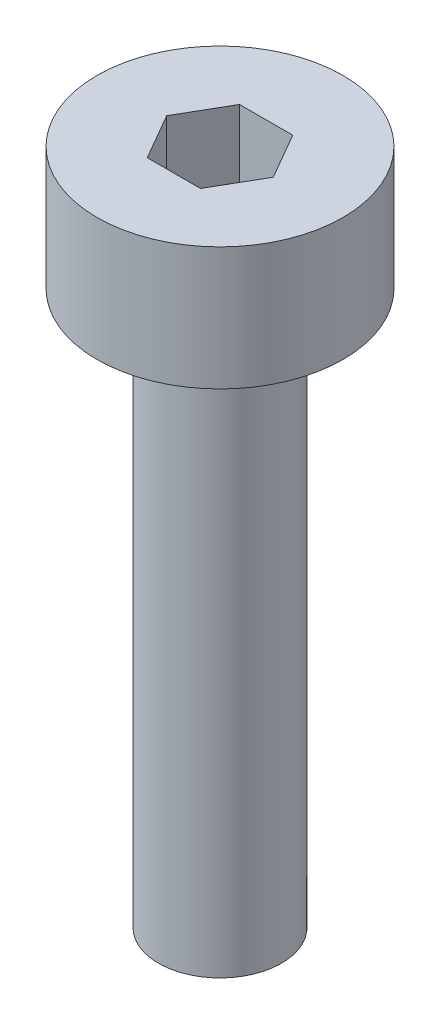
ISO-10303-21;
HEADER;
FILE_DESCRIPTION(('STEP AP214'),'2;1');
FILE_NAME('part.step','',(''),(''),'','','');
FILE_SCHEMA(('AUTOMOTIVE_DESIGN { 1 0 10303 214 1 1 1 1 }'));
ENDSEC;
DATA;
#1=APPLICATION_CONTEXT('core data for automotive mechanical design processes');
#2=APPLICATION_PROTOCOL_DEFINITION('international standard','automotive_design',2000,#1);
#3=PRODUCT_CONTEXT('',#1,'mechanical');
#4=PRODUCT('Part','Part','',(#3));
#5=PRODUCT_RELATED_PRODUCT_CATEGORY('part','',(#4));
#6=PRODUCT_DEFINITION_FORMATION('','',#4);
#7=PRODUCT_DEFINITION_CONTEXT('part definition',#1,'design');
#8=PRODUCT_DEFINITION('design','',#6,#7);
#9=PRODUCT_DEFINITION_SHAPE('','',#8);
#10=(LENGTH_UNIT() NAMED_UNIT(*) SI_UNIT(.MILLI.,.METRE.));
#11=(NAMED_UNIT(*) PLANE_ANGLE_UNIT() SI_UNIT($,.RADIAN.));
#12=(NAMED_UNIT(*) SI_UNIT($,.STERADIAN.) SOLID_ANGLE_UNIT());
#13=UNCERTAINTY_MEASURE_WITH_UNIT(LENGTH_MEASURE(1.E-05),#10,'distance_accuracy_value','');
#14=(GEOMETRIC_REPRESENTATION_CONTEXT(3) GLOBAL_UNCERTAINTY_ASSIGNED_CONTEXT((#13)) GLOBAL_UNIT_ASSIGNED_CONTEXT((#10,
#11,#12)) REPRESENTATION_CONTEXT('',''));
#15=CARTESIAN_POINT('',(0.,0.,0.));
#16=DIRECTION('',(0.,0.,1.));
#17=DIRECTION('',(1.,0.,0.));
#18=AXIS2_PLACEMENT_3D('',#15,#16,#17);
#19=CARTESIAN_POINT('',(0.,2.,0.));
#20=DIRECTION('',(0.,-1.,0.));
#21=DIRECTION('',(0.,0.,-1.));
#22=AXIS2_PLACEMENT_3D('',#19,#20,#21);
#23=CYLINDRICAL_SURFACE('',#22,2.);
#24=CARTESIAN_POINT('',(0.,2.,0.));
#25=DIRECTION('',(0.,1.,0.));
#26=DIRECTION('',(0.,0.,1.));
#27=AXIS2_PLACEMENT_3D('',#24,#25,#26);
#28=CIRCLE('',#27,2.);
#29=CARTESIAN_POINT('',(0.,2.,2.));
#30=VERTEX_POINT('',#29);
#31=EDGE_CURVE('E43',#30,#30,#28,.T.);
#32=ORIENTED_EDGE('',*,*,#31,.F.);
#33=EDGE_LOOP('',(#32));
#34=FACE_BOUND('',#33,.T.);
#35=CARTESIAN_POINT('',(0.,0.,0.));
#36=DIRECTION('',(0.,1.,0.));
#37=DIRECTION('',(0.,0.,1.));
#38=AXIS2_PLACEMENT_3D('',#35,#36,#37);
#39=CIRCLE('',#38,2.);
#40=CARTESIAN_POINT('',(0.,0.,2.));
#41=VERTEX_POINT('',#40);
#42=EDGE_CURVE('E38',#41,#41,#39,.T.);
#43=ORIENTED_EDGE('',*,*,#42,.T.);
#44=EDGE_LOOP('',(#43));
#45=FACE_BOUND('',#44,.T.);
#46=ADVANCED_FACE('F35',(#34,#45),#23,.T.);
#47=CARTESIAN_POINT('',(0.,2.,0.));
#48=DIRECTION('',(0.,1.,0.));
#49=DIRECTION('',(0.,0.,1.));
#50=AXIS2_PLACEMENT_3D('',#47,#48,#49);
#51=PLANE('',#50);
#52=DIRECTION('',(0.5,0.,-0.866025403784439));
#53=VECTOR('',#52,1.);
#54=CARTESIAN_POINT('',(0.433012701892219,2.,0.75));
#55=LINE('',#54,#53);
#56=CARTESIAN_POINT('',(0.433012701892219,2.,0.75));
#57=VERTEX_POINT('',#56);
#58=CARTESIAN_POINT('',(0.866025403784438,2.,0.));
#59=VERTEX_POINT('',#58);
#60=EDGE_CURVE('E51',#57,#59,#55,.T.);
#61=ORIENTED_EDGE('',*,*,#60,.F.);
#62=DIRECTION('',(1.,0.,0.));
#63=VECTOR('',#62,1.);
#64=CARTESIAN_POINT('',(-0.43301270189222,2.,0.75));
#65=LINE('',#64,#63);
#66=CARTESIAN_POINT('',(-0.43301270189222,2.,0.75));
#67=VERTEX_POINT('',#66);
#68=EDGE_CURVE('E135',#67,#57,#65,.T.);
#69=ORIENTED_EDGE('',*,*,#68,.F.);
#70=DIRECTION('',(0.5,0.,0.866025403784439));
#71=VECTOR('',#70,1.);
#72=CARTESIAN_POINT('',(-0.866025403784439,2.,0.));
#73=LINE('',#72,#71);
#74=CARTESIAN_POINT('',(-0.866025403784439,2.,0.));
#75=VERTEX_POINT('',#74);
#76=EDGE_CURVE('E133',#75,#67,#73,.T.);
#77=ORIENTED_EDGE('',*,*,#76,.F.);
#78=DIRECTION('',(-0.5,0.,0.866025403784439));
#79=VECTOR('',#78,1.);
#80=CARTESIAN_POINT('',(-0.43301270189222,2.,-0.750000000000001));
#81=LINE('',#80,#79);
#82=CARTESIAN_POINT('',(-0.43301270189222,2.,-0.750000000000001));
#83=VERTEX_POINT('',#82);
#84=EDGE_CURVE('E99',#83,#75,#81,.T.);
#85=ORIENTED_EDGE('',*,*,#84,.F.);
#86=DIRECTION('',(-1.,0.,0.));
#87=VECTOR('',#86,1.);
#88=CARTESIAN_POINT('',(0.433012701892219,2.,-0.75));
#89=LINE('',#88,#87);
#90=CARTESIAN_POINT('',(0.433012701892219,2.,-0.75));
#91=VERTEX_POINT('',#90);
#92=EDGE_CURVE('E129',#91,#83,#89,.T.);
#93=ORIENTED_EDGE('',*,*,#92,.F.);
#94=DIRECTION('',(-0.5,0.,-0.866025403784439));
#95=VECTOR('',#94,1.);
#96=CARTESIAN_POINT('',(0.866025403784438,2.,0.));
#97=LINE('',#96,#95);
#98=EDGE_CURVE('E125',#59,#91,#97,.T.);
#99=ORIENTED_EDGE('',*,*,#98,.F.);
#100=EDGE_LOOP('',(#61,#69,#77,#85,#93,#99));
#101=FACE_BOUND('',#100,.T.);
#102=ORIENTED_EDGE('',*,*,#31,.T.);
#103=EDGE_LOOP('',(#102));
#104=FACE_BOUND('',#103,.T.);
#105=ADVANCED_FACE('F153',(#101,#104),#51,.T.);
#106=CARTESIAN_POINT('',(0.,0.,0.));
#107=DIRECTION('',(0.,1.,0.));
#108=DIRECTION('',(0.,0.,1.));
#109=AXIS2_PLACEMENT_3D('',#106,#107,#108);
#110=PLANE('',#109);
#111=CARTESIAN_POINT('',(0.,0.,0.));
#112=DIRECTION('',(0.,-1.,0.));
#113=DIRECTION('',(0.,0.,-1.));
#114=AXIS2_PLACEMENT_3D('',#111,#112,#113);
#115=CIRCLE('',#114,1.);
#116=CARTESIAN_POINT('',(0.,0.,-1.));
#117=VERTEX_POINT('',#116);
#118=EDGE_CURVE('E11',#117,#117,#115,.T.);
#119=ORIENTED_EDGE('',*,*,#118,.F.);
#120=EDGE_LOOP('',(#119));
#121=FACE_BOUND('',#120,.T.);
#122=ORIENTED_EDGE('',*,*,#42,.F.);
#123=EDGE_LOOP('',(#122));
#124=FACE_BOUND('',#123,.T.);
#125=ADVANCED_FACE('F150',(#121,#124),#110,.F.);
#126=CARTESIAN_POINT('',(0.433012701892219,0.5,0.75));
#127=DIRECTION('',(0.866025403784439,0.,0.5));
#128=DIRECTION('',(0.5,0.,-0.866025403784439));
#129=AXIS2_PLACEMENT_3D('',#126,#127,#128);
#130=PLANE('',#129);
#131=ORIENTED_EDGE('',*,*,#60,.T.);
#132=DIRECTION('',(0.,1.,0.));
#133=VECTOR('',#132,1.);
#134=CARTESIAN_POINT('',(0.866025403784438,0.5,0.));
#135=LINE('',#134,#133);
#136=CARTESIAN_POINT('',(0.866025403784438,0.5,0.));
#137=VERTEX_POINT('',#136);
#138=EDGE_CURVE('E81',#137,#59,#135,.T.);
#139=ORIENTED_EDGE('',*,*,#138,.F.);
#140=DIRECTION('',(0.5,0.,-0.866025403784439));
#141=VECTOR('',#140,1.);
#142=CARTESIAN_POINT('',(0.433012701892219,0.5,0.75));
#143=LINE('',#142,#141);
#144=CARTESIAN_POINT('',(0.433012701892219,0.5,0.75));
#145=VERTEX_POINT('',#144);
#146=EDGE_CURVE('E137',#145,#137,#143,.T.);
#147=ORIENTED_EDGE('',*,*,#146,.F.);
#148=DIRECTION('',(0.,1.,0.));
#149=VECTOR('',#148,1.);
#150=CARTESIAN_POINT('',(0.433012701892219,0.5,0.75));
#151=LINE('',#150,#149);
#152=EDGE_CURVE('E59',#145,#57,#151,.T.);
#153=ORIENTED_EDGE('',*,*,#152,.T.);
#154=EDGE_LOOP('',(#131,#139,#147,#153));
#155=FACE_BOUND('',#154,.T.);
#156=ADVANCED_FACE('F152',(#155),#130,.F.);
#157=CARTESIAN_POINT('',(-0.43301270189222,0.5,0.75));
#158=DIRECTION('',(0.,0.,1.));
#159=DIRECTION('',(1.,0.,0.));
#160=AXIS2_PLACEMENT_3D('',#157,#158,#159);
#161=PLANE('',#160);
#162=ORIENTED_EDGE('',*,*,#68,.T.);
#163=ORIENTED_EDGE('',*,*,#152,.F.);
#164=DIRECTION('',(1.,0.,0.));
#165=VECTOR('',#164,1.);
#166=CARTESIAN_POINT('',(-0.43301270189222,0.5,0.75));
#167=LINE('',#166,#165);
#168=CARTESIAN_POINT('',(-0.43301270189222,0.5,0.75));
#169=VERTEX_POINT('',#168);
#170=EDGE_CURVE('E111',#169,#145,#167,.T.);
#171=ORIENTED_EDGE('',*,*,#170,.F.);
#172=DIRECTION('',(0.,1.,0.));
#173=VECTOR('',#172,1.);
#174=CARTESIAN_POINT('',(-0.43301270189222,0.5,0.75));
#175=LINE('',#174,#173);
#176=EDGE_CURVE('E103',#169,#67,#175,.T.);
#177=ORIENTED_EDGE('',*,*,#176,.T.);
#178=EDGE_LOOP('',(#162,#163,#171,#177));
#179=FACE_BOUND('',#178,.T.);
#180=ADVANCED_FACE('F159',(#179),#161,.F.);
#181=CARTESIAN_POINT('',(-0.866025403784439,0.5,0.));
#182=DIRECTION('',(-0.866025403784439,0.,0.5));
#183=DIRECTION('',(0.5,0.,0.866025403784439));
#184=AXIS2_PLACEMENT_3D('',#181,#182,#183);
#185=PLANE('',#184);
#186=ORIENTED_EDGE('',*,*,#76,.T.);
#187=ORIENTED_EDGE('',*,*,#176,.F.);
#188=DIRECTION('',(0.5,0.,0.866025403784439));
#189=VECTOR('',#188,1.);
#190=CARTESIAN_POINT('',(-0.866025403784439,0.5,0.));
#191=LINE('',#190,#189);
#192=CARTESIAN_POINT('',(-0.866025403784439,0.5,0.));
#193=VERTEX_POINT('',#192);
#194=EDGE_CURVE('E107',#193,#169,#191,.T.);
#195=ORIENTED_EDGE('',*,*,#194,.F.);
#196=DIRECTION('',(0.,1.,0.));
#197=VECTOR('',#196,1.);
#198=CARTESIAN_POINT('',(-0.866025403784439,0.5,0.));
#199=LINE('',#198,#197);
#200=EDGE_CURVE('E92',#193,#75,#199,.T.);
#201=ORIENTED_EDGE('',*,*,#200,.T.);
#202=EDGE_LOOP('',(#186,#187,#195,#201));
#203=FACE_BOUND('',#202,.T.);
#204=ADVANCED_FACE('F108',(#203),#185,.F.);
#205=CARTESIAN_POINT('',(-0.43301270189222,0.5,-0.750000000000001));
#206=DIRECTION('',(-0.866025403784439,0.,-0.5));
#207=DIRECTION('',(-0.5,0.,0.866025403784439));
#208=AXIS2_PLACEMENT_3D('',#205,#206,#207);
#209=PLANE('',#208);
#210=ORIENTED_EDGE('',*,*,#84,.T.);
#211=ORIENTED_EDGE('',*,*,#200,.F.);
#212=DIRECTION('',(-0.5,0.,0.866025403784439));
#213=VECTOR('',#212,1.);
#214=CARTESIAN_POINT('',(-0.43301270189222,0.5,-0.750000000000001));
#215=LINE('',#214,#213);
#216=CARTESIAN_POINT('',(-0.43301270189222,0.5,-0.750000000000001));
#217=VERTEX_POINT('',#216);
#218=EDGE_CURVE('E96',#217,#193,#215,.T.);
#219=ORIENTED_EDGE('',*,*,#218,.F.);
#220=DIRECTION('',(0.,1.,0.));
#221=VECTOR('',#220,1.);
#222=CARTESIAN_POINT('',(-0.43301270189222,0.5,-0.750000000000001));
#223=LINE('',#222,#221);
#224=EDGE_CURVE('E104',#217,#83,#223,.T.);
#225=ORIENTED_EDGE('',*,*,#224,.T.);
#226=EDGE_LOOP('',(#210,#211,#219,#225));
#227=FACE_BOUND('',#226,.T.);
#228=ADVANCED_FACE('F94',(#227),#209,.F.);
#229=CARTESIAN_POINT('',(0.433012701892219,0.5,-0.75));
#230=DIRECTION('',(0.,0.,-1.));
#231=DIRECTION('',(-1.,0.,0.));
#232=AXIS2_PLACEMENT_3D('',#229,#230,#231);
#233=PLANE('',#232);
#234=ORIENTED_EDGE('',*,*,#92,.T.);
#235=ORIENTED_EDGE('',*,*,#224,.F.);
#236=DIRECTION('',(-1.,0.,0.));
#237=VECTOR('',#236,1.);
#238=CARTESIAN_POINT('',(0.433012701892219,0.5,-0.75));
#239=LINE('',#238,#237);
#240=CARTESIAN_POINT('',(0.433012701892219,0.5,-0.75));
#241=VERTEX_POINT('',#240);
#242=EDGE_CURVE('E117',#241,#217,#239,.T.);
#243=ORIENTED_EDGE('',*,*,#242,.F.);
#244=DIRECTION('',(0.,1.,0.));
#245=VECTOR('',#244,1.);
#246=CARTESIAN_POINT('',(0.433012701892219,0.5,-0.75));
#247=LINE('',#246,#245);
#248=EDGE_CURVE('E141',#241,#91,#247,.T.);
#249=ORIENTED_EDGE('',*,*,#248,.T.);
#250=EDGE_LOOP('',(#234,#235,#243,#249));
#251=FACE_BOUND('',#250,.T.);
#252=ADVANCED_FACE('F204',(#251),#233,.F.);
#253=CARTESIAN_POINT('',(0.866025403784438,0.5,0.));
#254=DIRECTION('',(0.866025403784438,0.,-0.5));
#255=DIRECTION('',(-0.5,0.,-0.866025403784439));
#256=AXIS2_PLACEMENT_3D('',#253,#254,#255);
#257=PLANE('',#256);
#258=ORIENTED_EDGE('',*,*,#98,.T.);
#259=ORIENTED_EDGE('',*,*,#248,.F.);
#260=DIRECTION('',(-0.5,0.,-0.866025403784439));
#261=VECTOR('',#260,1.);
#262=CARTESIAN_POINT('',(0.866025403784438,0.5,0.));
#263=LINE('',#262,#261);
#264=EDGE_CURVE('E119',#137,#241,#263,.T.);
#265=ORIENTED_EDGE('',*,*,#264,.F.);
#266=ORIENTED_EDGE('',*,*,#138,.T.);
#267=EDGE_LOOP('',(#258,#259,#265,#266));
#268=FACE_BOUND('',#267,.T.);
#269=ADVANCED_FACE('F213',(#268),#257,.F.);
#270=CARTESIAN_POINT('',(0.,0.5,0.));
#271=DIRECTION('',(0.,1.,0.));
#272=DIRECTION('',(0.,0.,1.));
#273=AXIS2_PLACEMENT_3D('',#270,#271,#272);
#274=PLANE('',#273);
#275=ORIENTED_EDGE('',*,*,#146,.T.);
#276=ORIENTED_EDGE('',*,*,#264,.T.);
#277=ORIENTED_EDGE('',*,*,#242,.T.);
#278=ORIENTED_EDGE('',*,*,#218,.T.);
#279=ORIENTED_EDGE('',*,*,#194,.T.);
#280=ORIENTED_EDGE('',*,*,#170,.T.);
#281=EDGE_LOOP('',(#275,#276,#277,#278,#279,#280));
#282=FACE_BOUND('',#281,.T.);
#283=ADVANCED_FACE('F114',(#282),#274,.T.);
#284=CARTESIAN_POINT('',(0.,-9.,0.));
#285=DIRECTION('',(0.,1.,0.));
#286=DIRECTION('',(0.,0.,1.));
#287=AXIS2_PLACEMENT_3D('',#284,#285,#286);
#288=CYLINDRICAL_SURFACE('',#287,1.);
#289=CARTESIAN_POINT('',(0.,-9.,0.));
#290=DIRECTION('',(0.,-1.,0.));
#291=DIRECTION('',(0.,0.,-1.));
#292=AXIS2_PLACEMENT_3D('',#289,#290,#291);
#293=CIRCLE('',#292,1.);
#294=CARTESIAN_POINT('',(0.,-9.,-1.));
#295=VERTEX_POINT('',#294);
#296=EDGE_CURVE('E126',#295,#295,#293,.T.);
#297=ORIENTED_EDGE('',*,*,#296,.F.);
#298=EDGE_LOOP('',(#297));
#299=FACE_BOUND('',#298,.T.);
#300=ORIENTED_EDGE('',*,*,#118,.T.);
#301=EDGE_LOOP('',(#300));
#302=FACE_BOUND('',#301,.T.);
#303=ADVANCED_FACE('F231',(#299,#302),#288,.T.);
#304=CARTESIAN_POINT('',(0.,-9.,0.));
#305=DIRECTION('',(0.,-1.,0.));
#306=DIRECTION('',(0.,0.,-1.));
#307=AXIS2_PLACEMENT_3D('',#304,#305,#306);
#308=PLANE('',#307);
#309=ORIENTED_EDGE('',*,*,#296,.T.);
#310=EDGE_LOOP('',(#309));
#311=FACE_BOUND('',#310,.T.);
#312=ADVANCED_FACE('F244',(#311),#308,.T.);
#313=CLOSED_SHELL('',(#46,#105,#125,#156,#180,#204,#228,#252,#269,#283,#303,#312));
#314=MANIFOLD_SOLID_BREP('B2',#313);
#315=ADVANCED_BREP_SHAPE_REPRESENTATION('',(#18,#314),#14);
#316=SHAPE_DEFINITION_REPRESENTATION(#9,#315);
ENDSEC;
END-ISO-10303-21;
